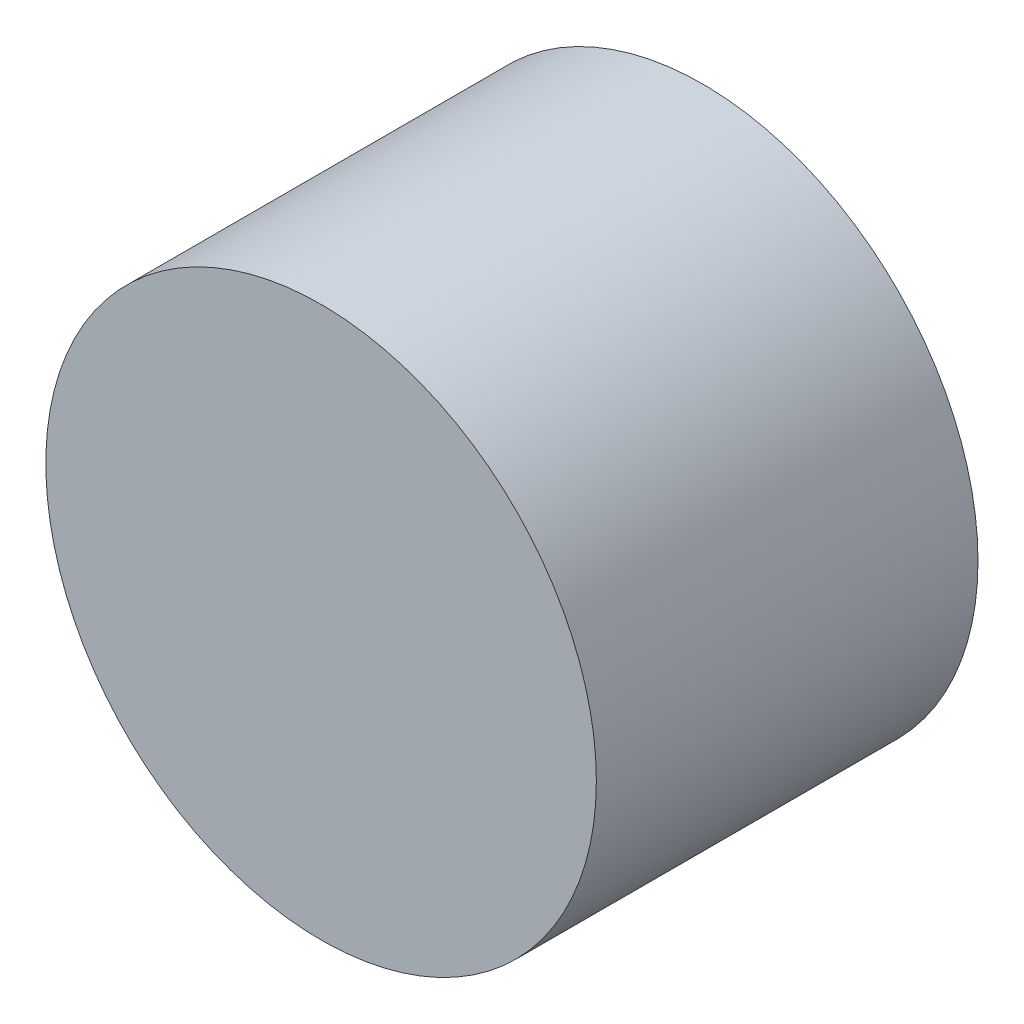
ISO-10303-21;
HEADER;
FILE_DESCRIPTION(('STEP AP214'),'2;1');
FILE_NAME('part.step','',(''),(''),'','','');
FILE_SCHEMA(('AUTOMOTIVE_DESIGN { 1 0 10303 214 1 1 1 1 }'));
ENDSEC;
DATA;
#1=APPLICATION_CONTEXT('core data for automotive mechanical design processes');
#2=APPLICATION_PROTOCOL_DEFINITION('international standard','automotive_design',2000,#1);
#3=PRODUCT_CONTEXT('',#1,'mechanical');
#4=PRODUCT('Part','Part','',(#3));
#5=PRODUCT_RELATED_PRODUCT_CATEGORY('part','',(#4));
#6=PRODUCT_DEFINITION_FORMATION('','',#4);
#7=PRODUCT_DEFINITION_CONTEXT('part definition',#1,'design');
#8=PRODUCT_DEFINITION('design','',#6,#7);
#9=PRODUCT_DEFINITION_SHAPE('','',#8);
#10=(LENGTH_UNIT() NAMED_UNIT(*) SI_UNIT(.MILLI.,.METRE.));
#11=(NAMED_UNIT(*) PLANE_ANGLE_UNIT() SI_UNIT($,.RADIAN.));
#12=(NAMED_UNIT(*) SI_UNIT($,.STERADIAN.) SOLID_ANGLE_UNIT());
#13=UNCERTAINTY_MEASURE_WITH_UNIT(LENGTH_MEASURE(1.E-05),#10,'distance_accuracy_value','');
#14=(GEOMETRIC_REPRESENTATION_CONTEXT(3) GLOBAL_UNCERTAINTY_ASSIGNED_CONTEXT((#13)) GLOBAL_UNIT_ASSIGNED_CONTEXT((#10,
#11,#12)) REPRESENTATION_CONTEXT('',''));
#15=CARTESIAN_POINT('',(0.,0.,0.));
#16=DIRECTION('',(0.,0.,1.));
#17=DIRECTION('',(1.,0.,0.));
#18=AXIS2_PLACEMENT_3D('',#15,#16,#17);
#19=CARTESIAN_POINT('',(0.,0.,-5.));
#20=DIRECTION('',(0.,0.,1.));
#21=DIRECTION('',(1.,0.,0.));
#22=AXIS2_PLACEMENT_3D('',#19,#20,#21);
#23=CYLINDRICAL_SURFACE('',#22,75.7322787694418);
#24=CARTESIAN_POINT('',(0.,0.,-5.));
#25=DIRECTION('',(0.,0.,1.));
#26=DIRECTION('',(1.,0.,0.));
#27=AXIS2_PLACEMENT_3D('',#24,#25,#26);
#28=CIRCLE('',#27,75.7322787694418);
#29=CARTESIAN_POINT('',(75.7322787694418,0.,-5.));
#30=VERTEX_POINT('',#29);
#31=EDGE_CURVE('E11',#30,#30,#28,.T.);
#32=ORIENTED_EDGE('',*,*,#31,.T.);
#33=EDGE_LOOP('',(#32));
#34=FACE_BOUND('',#33,.T.);
#35=CARTESIAN_POINT('',(0.,0.,100.));
#36=DIRECTION('',(0.,0.,1.));
#37=DIRECTION('',(1.,0.,0.));
#38=AXIS2_PLACEMENT_3D('',#35,#36,#37);
#39=CIRCLE('',#38,75.7322787694418);
#40=CARTESIAN_POINT('',(75.7322787694418,0.,100.));
#41=VERTEX_POINT('',#40);
#42=EDGE_CURVE('E43',#41,#41,#39,.T.);
#43=ORIENTED_EDGE('',*,*,#42,.F.);
#44=EDGE_LOOP('',(#43));
#45=FACE_BOUND('',#44,.T.);
#46=ADVANCED_FACE('F37',(#34,#45),#23,.T.);
#47=CARTESIAN_POINT('',(0.,0.,-5.));
#48=DIRECTION('',(0.,0.,1.));
#49=DIRECTION('',(1.,0.,0.));
#50=AXIS2_PLACEMENT_3D('',#47,#48,#49);
#51=PLANE('',#50);
#52=CARTESIAN_POINT('',(0.,0.,-5.));
#53=DIRECTION('',(0.,0.,-1.));
#54=DIRECTION('',(-1.,0.,0.));
#55=AXIS2_PLACEMENT_3D('',#52,#53,#54);
#56=CIRCLE('',#55,3.5);
#57=CARTESIAN_POINT('',(-3.5,0.,-5.));
#58=VERTEX_POINT('',#57);
#59=EDGE_CURVE('E56',#58,#58,#56,.T.);
#60=ORIENTED_EDGE('',*,*,#59,.F.);
#61=EDGE_LOOP('',(#60));
#62=FACE_BOUND('',#61,.T.);
#63=ORIENTED_EDGE('',*,*,#31,.F.);
#64=EDGE_LOOP('',(#63));
#65=FACE_BOUND('',#64,.T.);
#66=ADVANCED_FACE('F64',(#62,#65),#51,.F.);
#67=CARTESIAN_POINT('',(0.,0.,100.));
#68=DIRECTION('',(0.,0.,1.));
#69=DIRECTION('',(1.,0.,0.));
#70=AXIS2_PLACEMENT_3D('',#67,#68,#69);
#71=PLANE('',#70);
#72=ORIENTED_EDGE('',*,*,#42,.T.);
#73=EDGE_LOOP('',(#72));
#74=FACE_BOUND('',#73,.T.);
#75=ADVANCED_FACE('F50',(#74),#71,.T.);
#76=CARTESIAN_POINT('',(0.,0.,45.));
#77=DIRECTION('',(0.,0.,-1.));
#78=DIRECTION('',(-1.,0.,0.));
#79=AXIS2_PLACEMENT_3D('',#76,#77,#78);
#80=CONICAL_SURFACE('',#79,3.49999999999999,1.02974425867665);
#81=CARTESIAN_POINT('',(0.,0.,47.1030121665965));
#82=VERTEX_POINT('',#81);
#83=VERTEX_LOOP('',#82);
#84=FACE_BOUND('',#83,.T.);
#85=CARTESIAN_POINT('',(0.,0.,45.));
#86=DIRECTION('',(0.,0.,-1.));
#87=DIRECTION('',(-1.,0.,0.));
#88=AXIS2_PLACEMENT_3D('',#85,#86,#87);
#89=CIRCLE('',#88,3.49999999999999);
#90=CARTESIAN_POINT('',(-3.49999999999999,0.,45.));
#91=VERTEX_POINT('',#90);
#92=EDGE_CURVE('E54',#91,#91,#89,.T.);
#93=ORIENTED_EDGE('',*,*,#92,.T.);
#94=EDGE_LOOP('',(#93));
#95=FACE_BOUND('',#94,.T.);
#96=ADVANCED_FACE('F46',(#84,#95),#80,.F.);
#97=CARTESIAN_POINT('',(0.,0.,-5.));
#98=DIRECTION('',(0.,0.,-1.));
#99=DIRECTION('',(-1.,0.,0.));
#100=AXIS2_PLACEMENT_3D('',#97,#98,#99);
#101=CYLINDRICAL_SURFACE('',#100,3.49999999999999);
#102=ORIENTED_EDGE('',*,*,#92,.F.);
#103=EDGE_LOOP('',(#102));
#104=FACE_BOUND('',#103,.T.);
#105=ORIENTED_EDGE('',*,*,#59,.T.);
#106=EDGE_LOOP('',(#105));
#107=FACE_BOUND('',#106,.T.);
#108=ADVANCED_FACE('F49',(#104,#107),#101,.F.);
#109=CLOSED_SHELL('',(#46,#66,#75,#96,#108));
#110=MANIFOLD_SOLID_BREP('B2',#109);
#111=ADVANCED_BREP_SHAPE_REPRESENTATION('',(#18,#110),#14);
#112=SHAPE_DEFINITION_REPRESENTATION(#9,#111);
ENDSEC;
END-ISO-10303-21;
